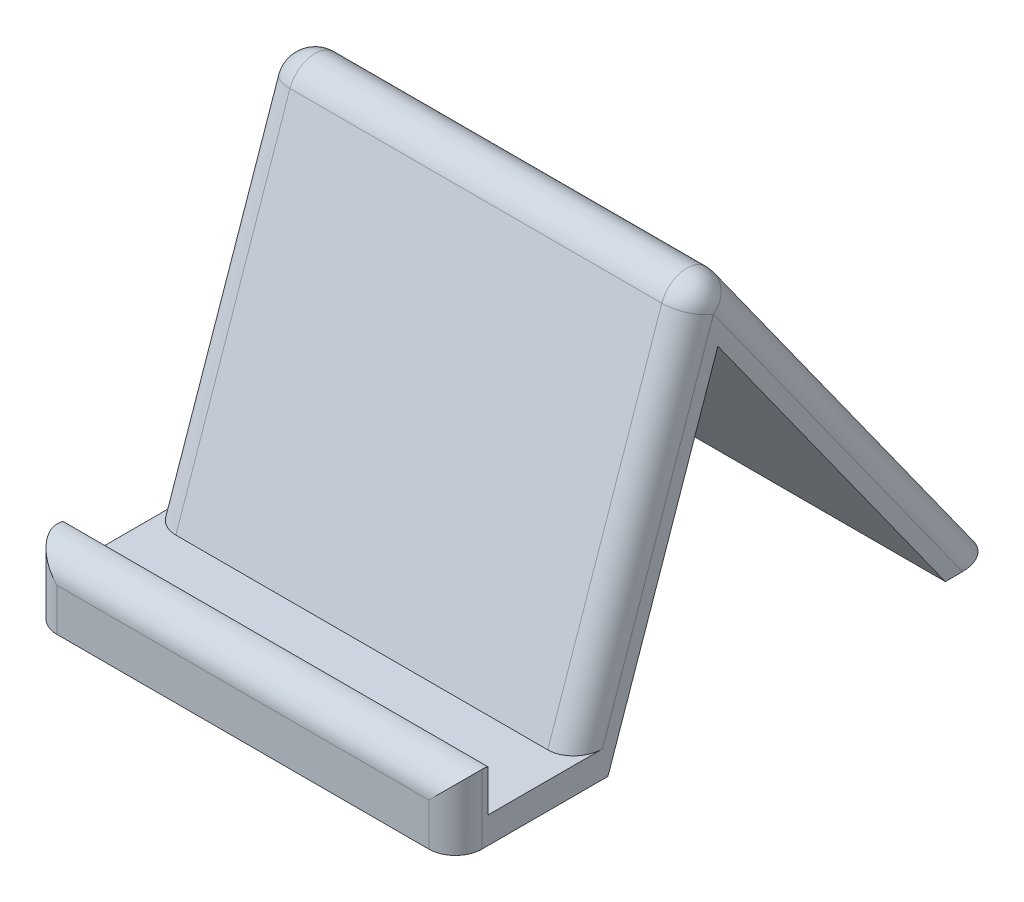
ISO-10303-21;
HEADER;
FILE_DESCRIPTION(('STEP AP214'),'2;1');
FILE_NAME('part.step','',(''),(''),'','','');
FILE_SCHEMA(('AUTOMOTIVE_DESIGN { 1 0 10303 214 1 1 1 1 }'));
ENDSEC;
DATA;
#1=APPLICATION_CONTEXT('core data for automotive mechanical design processes');
#2=APPLICATION_PROTOCOL_DEFINITION('international standard','automotive_design',2000,#1);
#3=PRODUCT_CONTEXT('',#1,'mechanical');
#4=PRODUCT('Part','Part','',(#3));
#5=PRODUCT_RELATED_PRODUCT_CATEGORY('part','',(#4));
#6=PRODUCT_DEFINITION_FORMATION('','',#4);
#7=PRODUCT_DEFINITION_CONTEXT('part definition',#1,'design');
#8=PRODUCT_DEFINITION('design','',#6,#7);
#9=PRODUCT_DEFINITION_SHAPE('','',#8);
#10=(LENGTH_UNIT() NAMED_UNIT(*) SI_UNIT(.MILLI.,.METRE.));
#11=(NAMED_UNIT(*) PLANE_ANGLE_UNIT() SI_UNIT($,.RADIAN.));
#12=(NAMED_UNIT(*) SI_UNIT($,.STERADIAN.) SOLID_ANGLE_UNIT());
#13=UNCERTAINTY_MEASURE_WITH_UNIT(LENGTH_MEASURE(1.E-05),#10,'distance_accuracy_value','');
#14=(GEOMETRIC_REPRESENTATION_CONTEXT(3) GLOBAL_UNCERTAINTY_ASSIGNED_CONTEXT((#13)) GLOBAL_UNIT_ASSIGNED_CONTEXT((#10,
#11,#12)) REPRESENTATION_CONTEXT('',''));
#15=CARTESIAN_POINT('',(0.,0.,0.));
#16=DIRECTION('',(0.,0.,1.));
#17=DIRECTION('',(1.,0.,0.));
#18=AXIS2_PLACEMENT_3D('',#15,#16,#17);
#19=CARTESIAN_POINT('',(0.,0.,0.));
#20=DIRECTION('',(0.,1.,0.));
#21=DIRECTION('',(0.,0.,1.));
#22=AXIS2_PLACEMENT_3D('',#19,#20,#21);
#23=PLANE('',#22);
#24=DIRECTION('',(0.,0.,1.));
#25=VECTOR('',#24,1.);
#26=CARTESIAN_POINT('',(-40.,0.,-50.8));
#27=LINE('',#26,#25);
#28=CARTESIAN_POINT('',(-40.,0.,-44.6495800448227));
#29=VERTEX_POINT('',#28);
#30=CARTESIAN_POINT('',(-40.,0.,-41.4267599883097));
#31=VERTEX_POINT('',#30);
#32=EDGE_CURVE('E245',#29,#31,#27,.T.);
#33=ORIENTED_EDGE('',*,*,#32,.F.);
#34=CARTESIAN_POINT('',(-35.,0.,-44.6495800448227));
#35=DIRECTION('',(0.,1.,0.));
#36=DIRECTION('',(0.,0.,1.));
#37=AXIS2_PLACEMENT_3D('',#34,#35,#36);
#38=ELLIPSE('',#37,6.15041995517734,5.);
#39=CARTESIAN_POINT('',(-35.,0.,-50.8));
#40=VERTEX_POINT('',#39);
#41=EDGE_CURVE('E205',#29,#40,#38,.F.);
#42=ORIENTED_EDGE('',*,*,#41,.T.);
#43=DIRECTION('',(-1.,0.,0.));
#44=VECTOR('',#43,1.);
#45=CARTESIAN_POINT('',(-40.,0.,-50.8));
#46=LINE('',#45,#44);
#47=CARTESIAN_POINT('',(35.,0.,-50.8));
#48=VERTEX_POINT('',#47);
#49=EDGE_CURVE('E312',#48,#40,#46,.T.);
#50=ORIENTED_EDGE('',*,*,#49,.F.);
#51=CARTESIAN_POINT('',(35.,0.,-44.6495800448227));
#52=DIRECTION('',(0.,1.,0.));
#53=DIRECTION('',(0.,0.,1.));
#54=AXIS2_PLACEMENT_3D('',#51,#52,#53);
#55=ELLIPSE('',#54,6.15041995517734,5.);
#56=CARTESIAN_POINT('',(40.,0.,-44.6495800448227));
#57=VERTEX_POINT('',#56);
#58=EDGE_CURVE('E203',#48,#57,#55,.F.);
#59=ORIENTED_EDGE('',*,*,#58,.T.);
#60=DIRECTION('',(0.,0.,-1.));
#61=VECTOR('',#60,1.);
#62=CARTESIAN_POINT('',(40.,0.,-50.8));
#63=LINE('',#62,#61);
#64=CARTESIAN_POINT('',(40.,0.,-41.4267599883097));
#65=VERTEX_POINT('',#64);
#66=EDGE_CURVE('E265',#65,#57,#63,.T.);
#67=ORIENTED_EDGE('',*,*,#66,.F.);
#68=DIRECTION('',(-1.,0.,0.));
#69=VECTOR('',#68,1.);
#70=CARTESIAN_POINT('',(40.,0.,-41.4267599883097));
#71=LINE('',#70,#69);
#72=EDGE_CURVE('E300',#65,#31,#71,.T.);
#73=ORIENTED_EDGE('',*,*,#72,.T.);
#74=EDGE_LOOP('',(#33,#42,#50,#59,#67,#73));
#75=FACE_BOUND('',#74,.T.);
#76=ADVANCED_FACE('F34',(#75),#23,.F.);
#77=CARTESIAN_POINT('',(40.,76.2,-50.8));
#78=DIRECTION('',(-1.,0.,0.));
#79=DIRECTION('',(0.,0.,1.));
#80=AXIS2_PLACEMENT_3D('',#77,#78,#79);
#81=PLANE('',#80);
#82=CARTESIAN_POINT('',(40.,8.01062292072602,45.8));
#83=DIRECTION('',(-1.,0.,0.));
#84=DIRECTION('',(0.,0.,1.));
#85=AXIS2_PLACEMENT_3D('',#82,#83,#84);
#86=CIRCLE('',#85,5.);
#87=CARTESIAN_POINT('',(40.,12.8859553397123,44.6904353086089));
#88=VERTEX_POINT('',#87);
#89=CARTESIAN_POINT('',(40.,13.010622920726,45.8));
#90=VERTEX_POINT('',#89);
#91=EDGE_CURVE('E153',#88,#90,#86,.F.);
#92=ORIENTED_EDGE('',*,*,#91,.T.);
#93=DIRECTION('',(0.,-1.,0.));
#94=VECTOR('',#93,1.);
#95=CARTESIAN_POINT('',(40.,76.2,45.8));
#96=LINE('',#95,#94);
#97=CARTESIAN_POINT('',(40.,0.,45.8));
#98=VERTEX_POINT('',#97);
#99=EDGE_CURVE('E177',#90,#98,#96,.T.);
#100=ORIENTED_EDGE('',*,*,#99,.T.);
#101=CARTESIAN_POINT('',(40.,0.,22.0867780607956));
#102=VERTEX_POINT('',#101);
#103=EDGE_CURVE('E311',#98,#102,#63,.T.);
#104=ORIENTED_EDGE('',*,*,#103,.T.);
#105=DIRECTION('',(0.,0.945024540522138,-0.326999415612509));
#106=VECTOR('',#105,1.);
#107=CARTESIAN_POINT('',(40.,0.,22.0867780607956));
#108=LINE('',#107,#106);
#109=CARTESIAN_POINT('',(40.,59.7866333350471,1.39927914018768));
#110=VERTEX_POINT('',#109);
#111=EDGE_CURVE('E296',#102,#110,#108,.T.);
#112=ORIENTED_EDGE('',*,*,#111,.T.);
#113=DIRECTION('',(0.,-0.812952617290965,-0.582329839558105));
#114=VECTOR('',#113,1.);
#115=CARTESIAN_POINT('',(40.,0.,-41.4267599883097));
#116=LINE('',#115,#114);
#117=EDGE_CURVE('E294',#110,#65,#116,.T.);
#118=ORIENTED_EDGE('',*,*,#117,.T.);
#119=ORIENTED_EDGE('',*,*,#66,.T.);
#120=DIRECTION('',(0.,-0.812952617290966,-0.582329839558105));
#121=VECTOR('',#120,1.);
#122=CARTESIAN_POINT('',(40.,73.2883508022095,7.84793660792689));
#123=LINE('',#122,#121);
#124=CARTESIAN_POINT('',(40.,65.4300743668288,2.21893836314897));
#125=VERTEX_POINT('',#124);
#126=EDGE_CURVE('E182',#57,#125,#123,.F.);
#127=ORIENTED_EDGE('',*,*,#126,.T.);
#128=DIRECTION('',(0.,0.945024540522138,-0.326999415612509));
#129=VECTOR('',#128,1.);
#130=CARTESIAN_POINT('',(40.,3.36500292193743,23.6948273185984));
#131=LINE('',#130,#129);
#132=CARTESIAN_POINT('',(40.,5.00000000000001,23.1290821277283));
#133=VERTEX_POINT('',#132);
#134=EDGE_CURVE('E178',#125,#133,#131,.F.);
#135=ORIENTED_EDGE('',*,*,#134,.T.);
#136=DIRECTION('',(0.,0.,1.));
#137=VECTOR('',#136,1.);
#138=CARTESIAN_POINT('',(40.,5.,-50.8));
#139=LINE('',#138,#137);
#140=CARTESIAN_POINT('',(40.,5.,44.6904353086089));
#141=VERTEX_POINT('',#140);
#142=EDGE_CURVE('E156',#133,#141,#139,.T.);
#143=ORIENTED_EDGE('',*,*,#142,.T.);
#144=DIRECTION('',(0.,1.,0.));
#145=VECTOR('',#144,1.);
#146=CARTESIAN_POINT('',(40.,76.2,44.6904353086089));
#147=LINE('',#146,#145);
#148=EDGE_CURVE('E148',#141,#88,#147,.T.);
#149=ORIENTED_EDGE('',*,*,#148,.T.);
#150=EDGE_LOOP('',(#92,#100,#104,#112,#118,#119,#127,#135,#143,#149));
#151=FACE_BOUND('',#150,.T.);
#152=ADVANCED_FACE('F150',(#151),#81,.F.);
#153=CARTESIAN_POINT('',(-40.,76.2,-50.8));
#154=DIRECTION('',(1.,0.,0.));
#155=DIRECTION('',(0.,0.,-1.));
#156=AXIS2_PLACEMENT_3D('',#153,#154,#155);
#157=PLANE('',#156);
#158=DIRECTION('',(0.,-1.,0.));
#159=VECTOR('',#158,1.);
#160=CARTESIAN_POINT('',(-40.,76.2,45.8));
#161=LINE('',#160,#159);
#162=CARTESIAN_POINT('',(-40.,0.,45.8));
#163=VERTEX_POINT('',#162);
#164=CARTESIAN_POINT('',(-40.,13.010622920726,45.8));
#165=VERTEX_POINT('',#164);
#166=EDGE_CURVE('E199',#163,#165,#161,.F.);
#167=ORIENTED_EDGE('',*,*,#166,.T.);
#168=CARTESIAN_POINT('',(-40.,8.01062292072602,45.8));
#169=DIRECTION('',(1.,0.,0.));
#170=DIRECTION('',(0.,0.,-1.));
#171=AXIS2_PLACEMENT_3D('',#168,#169,#170);
#172=CIRCLE('',#171,5.);
#173=CARTESIAN_POINT('',(-40.,12.8859553397123,44.6904353086089));
#174=VERTEX_POINT('',#173);
#175=EDGE_CURVE('E201',#165,#174,#172,.F.);
#176=ORIENTED_EDGE('',*,*,#175,.T.);
#177=DIRECTION('',(0.,-1.,0.));
#178=VECTOR('',#177,1.);
#179=CARTESIAN_POINT('',(-40.,76.2,44.6904353086089));
#180=LINE('',#179,#178);
#181=CARTESIAN_POINT('',(-40.,5.,44.6904353086089));
#182=VERTEX_POINT('',#181);
#183=EDGE_CURVE('E160',#174,#182,#180,.T.);
#184=ORIENTED_EDGE('',*,*,#183,.T.);
#185=DIRECTION('',(0.,0.,-1.));
#186=VECTOR('',#185,1.);
#187=CARTESIAN_POINT('',(-40.,5.,-50.8));
#188=LINE('',#187,#186);
#189=CARTESIAN_POINT('',(-40.,5.00000000000001,23.1290821277283));
#190=VERTEX_POINT('',#189);
#191=EDGE_CURVE('E168',#182,#190,#188,.T.);
#192=ORIENTED_EDGE('',*,*,#191,.T.);
#193=DIRECTION('',(0.,0.945024540522138,-0.326999415612509));
#194=VECTOR('',#193,1.);
#195=CARTESIAN_POINT('',(-40.,74.5650029219375,-0.94194918113862));
#196=LINE('',#195,#194);
#197=CARTESIAN_POINT('',(-40.,65.4300743668288,2.21893836314899));
#198=VERTEX_POINT('',#197);
#199=EDGE_CURVE('E197',#190,#198,#196,.T.);
#200=ORIENTED_EDGE('',*,*,#199,.T.);
#201=DIRECTION('',(0.,-0.812952617290966,-0.582329839558105));
#202=VECTOR('',#201,1.);
#203=CARTESIAN_POINT('',(-40.,-2.91164919779054,-46.7352369135452));
#204=LINE('',#203,#202);
#205=EDGE_CURVE('E195',#198,#29,#204,.T.);
#206=ORIENTED_EDGE('',*,*,#205,.T.);
#207=ORIENTED_EDGE('',*,*,#32,.T.);
#208=DIRECTION('',(0.,-0.812952617290965,-0.582329839558105));
#209=VECTOR('',#208,1.);
#210=CARTESIAN_POINT('',(-40.,0.,-41.4267599883097));
#211=LINE('',#210,#209);
#212=CARTESIAN_POINT('',(-40.,59.7866333350471,1.39927914018768));
#213=VERTEX_POINT('',#212);
#214=EDGE_CURVE('E293',#213,#31,#211,.T.);
#215=ORIENTED_EDGE('',*,*,#214,.F.);
#216=DIRECTION('',(0.,0.945024540522138,-0.326999415612509));
#217=VECTOR('',#216,1.);
#218=CARTESIAN_POINT('',(-40.,0.,22.0867780607956));
#219=LINE('',#218,#217);
#220=CARTESIAN_POINT('',(-40.,0.,22.0867780607956));
#221=VERTEX_POINT('',#220);
#222=EDGE_CURVE('E297',#221,#213,#219,.T.);
#223=ORIENTED_EDGE('',*,*,#222,.F.);
#224=EDGE_CURVE('E247',#221,#163,#27,.T.);
#225=ORIENTED_EDGE('',*,*,#224,.T.);
#226=EDGE_LOOP('',(#167,#176,#184,#192,#200,#206,#207,#215,#223,#225));
#227=FACE_BOUND('',#226,.T.);
#228=ADVANCED_FACE('F316',(#227),#157,.F.);
#229=CARTESIAN_POINT('',(-40.,76.2,50.8));
#230=DIRECTION('',(0.,0.,-1.));
#231=DIRECTION('',(-1.,0.,0.));
#232=AXIS2_PLACEMENT_3D('',#229,#230,#231);
#233=PLANE('',#232);
#234=DIRECTION('',(1.,0.,0.));
#235=VECTOR('',#234,1.);
#236=CARTESIAN_POINT('',(-40.,0.,50.8));
#237=LINE('',#236,#235);
#238=CARTESIAN_POINT('',(-35.,0.,50.8));
#239=VERTEX_POINT('',#238);
#240=CARTESIAN_POINT('',(35.,0.,50.8));
#241=VERTEX_POINT('',#240);
#242=EDGE_CURVE('E169',#239,#241,#237,.T.);
#243=ORIENTED_EDGE('',*,*,#242,.T.);
#244=DIRECTION('',(0.,-1.,0.));
#245=VECTOR('',#244,1.);
#246=CARTESIAN_POINT('',(35.,76.2,50.8));
#247=LINE('',#246,#245);
#248=CARTESIAN_POINT('',(35.,8.01062292072602,50.8));
#249=VERTEX_POINT('',#248);
#250=EDGE_CURVE('E193',#241,#249,#247,.F.);
#251=ORIENTED_EDGE('',*,*,#250,.T.);
#252=DIRECTION('',(1.,0.,0.));
#253=VECTOR('',#252,1.);
#254=CARTESIAN_POINT('',(-40.,8.01062292072602,50.8));
#255=LINE('',#254,#253);
#256=CARTESIAN_POINT('',(-35.,8.01062292072602,50.8));
#257=VERTEX_POINT('',#256);
#258=EDGE_CURVE('E191',#249,#257,#255,.F.);
#259=ORIENTED_EDGE('',*,*,#258,.T.);
#260=DIRECTION('',(0.,-1.,0.));
#261=VECTOR('',#260,1.);
#262=CARTESIAN_POINT('',(-35.,76.2,50.8));
#263=LINE('',#262,#261);
#264=EDGE_CURVE('E189',#257,#239,#263,.T.);
#265=ORIENTED_EDGE('',*,*,#264,.T.);
#266=EDGE_LOOP('',(#243,#251,#259,#265));
#267=FACE_BOUND('',#266,.T.);
#268=ADVANCED_FACE('F239',(#267),#233,.F.);
#269=ORIENTED_EDGE('',*,*,#103,.F.);
#270=CARTESIAN_POINT('',(35.,0.,45.8));
#271=DIRECTION('',(0.,1.,0.));
#272=DIRECTION('',(0.,0.,1.));
#273=AXIS2_PLACEMENT_3D('',#270,#271,#272);
#274=CIRCLE('',#273,5.);
#275=EDGE_CURVE('E187',#98,#241,#274,.F.);
#276=ORIENTED_EDGE('',*,*,#275,.T.);
#277=ORIENTED_EDGE('',*,*,#242,.F.);
#278=CARTESIAN_POINT('',(-35.,0.,45.8));
#279=DIRECTION('',(0.,1.,0.));
#280=DIRECTION('',(0.,0.,1.));
#281=AXIS2_PLACEMENT_3D('',#278,#279,#280);
#282=CIRCLE('',#281,5.);
#283=EDGE_CURVE('E180',#239,#163,#282,.F.);
#284=ORIENTED_EDGE('',*,*,#283,.T.);
#285=ORIENTED_EDGE('',*,*,#224,.F.);
#286=DIRECTION('',(-1.,0.,0.));
#287=VECTOR('',#286,1.);
#288=CARTESIAN_POINT('',(40.,0.,22.0867780607956));
#289=LINE('',#288,#287);
#290=EDGE_CURVE('E307',#102,#221,#289,.T.);
#291=ORIENTED_EDGE('',*,*,#290,.F.);
#292=EDGE_LOOP('',(#269,#276,#277,#284,#285,#291));
#293=FACE_BOUND('',#292,.T.);
#294=ADVANCED_FACE('F242',(#293),#23,.F.);
#295=CARTESIAN_POINT('',(40.,0.,-50.8));
#296=DIRECTION('',(0.,0.582329839558105,-0.812952617290966));
#297=DIRECTION('',(0.,0.812952617290966,0.582329839558105));
#298=AXIS2_PLACEMENT_3D('',#295,#296,#297);
#299=PLANE('',#298);
#300=ORIENTED_EDGE('',*,*,#49,.T.);
#301=DIRECTION('',(0.,-0.812952617290966,-0.582329839558105));
#302=VECTOR('',#301,1.);
#303=CARTESIAN_POINT('',(-35.,76.2,3.78317352147206));
#304=LINE('',#303,#302);
#305=CARTESIAN_POINT('',(-35.,68.3417235646194,-1.84582472330585));
#306=VERTEX_POINT('',#305);
#307=EDGE_CURVE('E56',#40,#306,#304,.F.);
#308=ORIENTED_EDGE('',*,*,#307,.T.);
#309=DIRECTION('',(-1.,0.,0.));
#310=VECTOR('',#309,1.);
#311=CARTESIAN_POINT('',(40.,68.3417235646193,-1.84582472330586));
#312=LINE('',#311,#310);
#313=CARTESIAN_POINT('',(35.,68.3417235646194,-1.84582472330585));
#314=VERTEX_POINT('',#313);
#315=EDGE_CURVE('E51',#306,#314,#312,.F.);
#316=ORIENTED_EDGE('',*,*,#315,.T.);
#317=DIRECTION('',(0.,-0.812952617290966,-0.582329839558105));
#318=VECTOR('',#317,1.);
#319=CARTESIAN_POINT('',(35.,0.,-50.8));
#320=LINE('',#319,#318);
#321=EDGE_CURVE('E208',#314,#48,#320,.T.);
#322=ORIENTED_EDGE('',*,*,#321,.T.);
#323=EDGE_LOOP('',(#300,#308,#316,#322));
#324=FACE_BOUND('',#323,.T.);
#325=ADVANCED_FACE('F341',(#324),#299,.T.);
#326=CARTESIAN_POINT('',(40.,76.2,3.78317352147207));
#327=DIRECTION('',(0.,0.326999415612509,0.945024540522138));
#328=DIRECTION('',(0.,-0.945024540522138,0.326999415612509));
#329=AXIS2_PLACEMENT_3D('',#326,#327,#328);
#330=PLANE('',#329);
#331=DIRECTION('',(1.,0.,0.));
#332=VECTOR('',#331,1.);
#333=CARTESIAN_POINT('',(-327.62079442322,5.,28.4199500212091));
#334=LINE('',#333,#332);
#335=CARTESIAN_POINT('',(-35.,5.,28.4199500212091));
#336=VERTEX_POINT('',#335);
#337=CARTESIAN_POINT('',(35.,5.,28.4199500212091));
#338=VERTEX_POINT('',#337);
#339=EDGE_CURVE('E285',#336,#338,#334,.T.);
#340=ORIENTED_EDGE('',*,*,#339,.T.);
#341=DIRECTION('',(0.,0.945024540522138,-0.326999415612509));
#342=VECTOR('',#341,1.);
#343=CARTESIAN_POINT('',(35.,76.2,3.78317352147207));
#344=LINE('',#343,#342);
#345=CARTESIAN_POINT('',(35.,67.0650714448914,6.94406106575967));
#346=VERTEX_POINT('',#345);
#347=EDGE_CURVE('E256',#338,#346,#344,.T.);
#348=ORIENTED_EDGE('',*,*,#347,.T.);
#349=DIRECTION('',(-1.,0.,0.));
#350=VECTOR('',#349,1.);
#351=CARTESIAN_POINT('',(40.,67.0650714448914,6.94406106575967));
#352=LINE('',#351,#350);
#353=CARTESIAN_POINT('',(-35.,67.0650714448914,6.94406106575967));
#354=VERTEX_POINT('',#353);
#355=EDGE_CURVE('E252',#346,#354,#352,.T.);
#356=ORIENTED_EDGE('',*,*,#355,.T.);
#357=DIRECTION('',(0.,0.945024540522138,-0.326999415612509));
#358=VECTOR('',#357,1.);
#359=CARTESIAN_POINT('',(-35.,4.99999999999998,28.4199500212091));
#360=LINE('',#359,#358);
#361=EDGE_CURVE('E254',#354,#336,#360,.F.);
#362=ORIENTED_EDGE('',*,*,#361,.T.);
#363=EDGE_LOOP('',(#340,#348,#356,#362));
#364=FACE_BOUND('',#363,.T.);
#365=ADVANCED_FACE('F283',(#364),#330,.T.);
#366=CARTESIAN_POINT('',(40.,0.,-41.4267599883097));
#367=DIRECTION('',(0.,0.582329839558105,-0.812952617290966));
#368=DIRECTION('',(0.,0.812952617290966,0.582329839558105));
#369=AXIS2_PLACEMENT_3D('',#366,#367,#368);
#370=PLANE('',#369);
#371=ORIENTED_EDGE('',*,*,#214,.T.);
#372=ORIENTED_EDGE('',*,*,#72,.F.);
#373=ORIENTED_EDGE('',*,*,#117,.F.);
#374=DIRECTION('',(-1.,0.,0.));
#375=VECTOR('',#374,1.);
#376=CARTESIAN_POINT('',(40.,59.7866333350471,1.39927914018768));
#377=LINE('',#376,#375);
#378=EDGE_CURVE('E305',#110,#213,#377,.T.);
#379=ORIENTED_EDGE('',*,*,#378,.T.);
#380=EDGE_LOOP('',(#371,#372,#373,#379));
#381=FACE_BOUND('',#380,.T.);
#382=ADVANCED_FACE('F381',(#381),#370,.F.);
#383=CARTESIAN_POINT('',(40.,0.,22.0867780607956));
#384=DIRECTION('',(0.,0.326999415612509,0.945024540522138));
#385=DIRECTION('',(0.,-0.945024540522138,0.326999415612509));
#386=AXIS2_PLACEMENT_3D('',#383,#384,#385);
#387=PLANE('',#386);
#388=ORIENTED_EDGE('',*,*,#222,.T.);
#389=ORIENTED_EDGE('',*,*,#378,.F.);
#390=ORIENTED_EDGE('',*,*,#111,.F.);
#391=ORIENTED_EDGE('',*,*,#290,.T.);
#392=EDGE_LOOP('',(#388,#389,#390,#391));
#393=FACE_BOUND('',#392,.T.);
#394=ADVANCED_FACE('F321',(#393),#387,.F.);
#395=CARTESIAN_POINT('',(-327.62079442322,5.,28.4199500212091));
#396=DIRECTION('',(0.,-1.,0.));
#397=DIRECTION('',(0.,0.,-1.));
#398=AXIS2_PLACEMENT_3D('',#395,#396,#397);
#399=PLANE('',#398);
#400=ORIENTED_EDGE('',*,*,#142,.F.);
#401=CARTESIAN_POINT('',(35.,5.,23.1290821277283));
#402=DIRECTION('',(0.,-1.,0.));
#403=DIRECTION('',(0.,0.,1.));
#404=AXIS2_PLACEMENT_3D('',#401,#402,#403);
#405=ELLIPSE('',#404,5.29086789348077,5.);
#406=EDGE_CURVE('E43',#133,#338,#405,.T.);
#407=ORIENTED_EDGE('',*,*,#406,.T.);
#408=ORIENTED_EDGE('',*,*,#339,.F.);
#409=CARTESIAN_POINT('',(-35.,5.,23.1290821277283));
#410=DIRECTION('',(0.,-1.,0.));
#411=DIRECTION('',(0.,0.,1.));
#412=AXIS2_PLACEMENT_3D('',#409,#410,#411);
#413=ELLIPSE('',#412,5.29086789348077,5.);
#414=EDGE_CURVE('E12',#336,#190,#413,.T.);
#415=ORIENTED_EDGE('',*,*,#414,.T.);
#416=ORIENTED_EDGE('',*,*,#191,.F.);
#417=DIRECTION('',(1.,0.,0.));
#418=VECTOR('',#417,1.);
#419=CARTESIAN_POINT('',(-327.62079442322,5.,44.6904353086089));
#420=LINE('',#419,#418);
#421=EDGE_CURVE('E228',#182,#141,#420,.T.);
#422=ORIENTED_EDGE('',*,*,#421,.T.);
#423=EDGE_LOOP('',(#400,#407,#408,#415,#416,#422));
#424=FACE_BOUND('',#423,.T.);
#425=ADVANCED_FACE('F373',(#424),#399,.F.);
#426=CARTESIAN_POINT('',(-327.62079442322,12.8859553397123,44.6904353086089));
#427=DIRECTION('',(0.,0.,1.));
#428=DIRECTION('',(1.,0.,0.));
#429=AXIS2_PLACEMENT_3D('',#426,#427,#428);
#430=PLANE('',#429);
#431=ORIENTED_EDGE('',*,*,#148,.F.);
#432=ORIENTED_EDGE('',*,*,#421,.F.);
#433=ORIENTED_EDGE('',*,*,#183,.F.);
#434=DIRECTION('',(1.,0.,0.));
#435=VECTOR('',#434,1.);
#436=CARTESIAN_POINT('',(40.,12.8859553397123,44.6904353086089));
#437=LINE('',#436,#435);
#438=EDGE_CURVE('E164',#174,#88,#437,.T.);
#439=ORIENTED_EDGE('',*,*,#438,.T.);
#440=EDGE_LOOP('',(#431,#432,#433,#439));
#441=FACE_BOUND('',#440,.T.);
#442=ADVANCED_FACE('F165',(#441),#430,.F.);
#443=CARTESIAN_POINT('',(-35.,91.4324301599054,-6.77845248152335));
#444=DIRECTION('',(0.,-0.945024540522138,0.326999415612509));
#445=DIRECTION('',(0.,-0.326999415612509,-0.945024540522138));
#446=AXIS2_PLACEMENT_3D('',#443,#444,#445);
#447=CYLINDRICAL_SURFACE('',#446,5.);
#448=ORIENTED_EDGE('',*,*,#414,.F.);
#449=ORIENTED_EDGE('',*,*,#361,.F.);
#450=CARTESIAN_POINT('',(-35.,65.4300743668288,2.21893836314897));
#451=DIRECTION('',(0.,0.94502454052214,-0.326999415612503));
#452=DIRECTION('',(0.,0.326999415612503,0.94502454052214));
#453=AXIS2_PLACEMENT_3D('',#450,#451,#452);
#454=CIRCLE('',#453,5.);
#455=EDGE_CURVE('E226',#198,#354,#454,.T.);
#456=ORIENTED_EDGE('',*,*,#455,.F.);
#457=ORIENTED_EDGE('',*,*,#199,.F.);
#458=EDGE_LOOP('',(#448,#449,#456,#457));
#459=FACE_BOUND('',#458,.T.);
#460=ADVANCED_FACE('F366',(#459),#447,.T.);
#461=CARTESIAN_POINT('',(-35.,47.4483179987791,-10.6616564932565));
#462=DIRECTION('',(0.,0.812952617290966,0.582329839558105));
#463=DIRECTION('',(0.,-0.582329839558105,0.812952617290966));
#464=AXIS2_PLACEMENT_3D('',#461,#462,#463);
#465=CYLINDRICAL_SURFACE('',#464,5.);
#466=ORIENTED_EDGE('',*,*,#41,.F.);
#467=ORIENTED_EDGE('',*,*,#205,.F.);
#468=CARTESIAN_POINT('',(-35.,65.4300743668288,2.21893836314897));
#469=DIRECTION('',(0.,0.812952617290966,0.582329839558105));
#470=DIRECTION('',(0.,-0.582329839558105,0.812952617290966));
#471=AXIS2_PLACEMENT_3D('',#468,#469,#470);
#472=CIRCLE('',#471,5.);
#473=EDGE_CURVE('E223',#306,#198,#472,.T.);
#474=ORIENTED_EDGE('',*,*,#473,.F.);
#475=ORIENTED_EDGE('',*,*,#307,.F.);
#476=EDGE_LOOP('',(#466,#467,#474,#475));
#477=FACE_BOUND('',#476,.T.);
#478=ADVANCED_FACE('F363',(#477),#465,.T.);
#479=CARTESIAN_POINT('',(-35.,65.4300743668288,2.21893836314898));
#480=DIRECTION('',(0.,0.,1.));
#481=DIRECTION('',(1.,0.,0.));
#482=AXIS2_PLACEMENT_3D('',#479,#480,#481);
#483=SPHERICAL_SURFACE('',#482,5.);
#484=ORIENTED_EDGE('',*,*,#473,.T.);
#485=ORIENTED_EDGE('',*,*,#455,.T.);
#486=CARTESIAN_POINT('',(-35.,65.4300743668288,2.21893836314898));
#487=DIRECTION('',(-1.,0.,0.));
#488=DIRECTION('',(0.,-1.,0.));
#489=AXIS2_PLACEMENT_3D('',#486,#487,#488);
#490=CIRCLE('',#489,5.);
#491=EDGE_CURVE('E220',#306,#354,#490,.F.);
#492=ORIENTED_EDGE('',*,*,#491,.F.);
#493=EDGE_LOOP('',(#484,#485,#492));
#494=FACE_BOUND('',#493,.T.);
#495=ADVANCED_FACE('F360',(#494),#483,.T.);
#496=CARTESIAN_POINT('',(40.,65.4300743668288,2.21893836314898));
#497=DIRECTION('',(-1.,0.,0.));
#498=DIRECTION('',(0.,0.,1.));
#499=AXIS2_PLACEMENT_3D('',#496,#497,#498);
#500=CYLINDRICAL_SURFACE('',#499,5.);
#501=ORIENTED_EDGE('',*,*,#491,.T.);
#502=ORIENTED_EDGE('',*,*,#355,.F.);
#503=CARTESIAN_POINT('',(35.,65.4300743668288,2.21893836314897));
#504=DIRECTION('',(1.,0.,0.));
#505=DIRECTION('',(0.,0.,-1.));
#506=AXIS2_PLACEMENT_3D('',#503,#504,#505);
#507=CIRCLE('',#506,5.);
#508=EDGE_CURVE('E217',#314,#346,#507,.T.);
#509=ORIENTED_EDGE('',*,*,#508,.F.);
#510=ORIENTED_EDGE('',*,*,#315,.F.);
#511=EDGE_LOOP('',(#501,#502,#509,#510));
#512=FACE_BOUND('',#511,.T.);
#513=ADVANCED_FACE('F278',(#512),#500,.T.);
#514=CARTESIAN_POINT('',(35.,-2.91164919779053,-46.7352369135452));
#515=DIRECTION('',(0.,0.812952617290966,0.582329839558105));
#516=DIRECTION('',(0.,-0.582329839558105,0.812952617290966));
#517=AXIS2_PLACEMENT_3D('',#514,#515,#516);
#518=CYLINDRICAL_SURFACE('',#517,5.);
#519=ORIENTED_EDGE('',*,*,#58,.F.);
#520=ORIENTED_EDGE('',*,*,#321,.F.);
#521=CARTESIAN_POINT('',(35.,65.4300743668288,2.21893836314898));
#522=DIRECTION('',(0.,0.812952617290966,0.582329839558105));
#523=DIRECTION('',(0.,-0.582329839558105,0.812952617290966));
#524=AXIS2_PLACEMENT_3D('',#521,#522,#523);
#525=CIRCLE('',#524,5.);
#526=EDGE_CURVE('E214',#125,#314,#525,.T.);
#527=ORIENTED_EDGE('',*,*,#526,.F.);
#528=ORIENTED_EDGE('',*,*,#126,.F.);
#529=EDGE_LOOP('',(#519,#520,#527,#528));
#530=FACE_BOUND('',#529,.T.);
#531=ADVANCED_FACE('F268',(#530),#518,.T.);
#532=CARTESIAN_POINT('',(35.,65.4300743668288,2.21893836314898));
#533=DIRECTION('',(0.,0.,1.));
#534=DIRECTION('',(1.,0.,0.));
#535=AXIS2_PLACEMENT_3D('',#532,#533,#534);
#536=SPHERICAL_SURFACE('',#535,5.);
#537=ORIENTED_EDGE('',*,*,#526,.T.);
#538=ORIENTED_EDGE('',*,*,#508,.T.);
#539=CARTESIAN_POINT('',(35.,65.4300743668288,2.21893836314898));
#540=DIRECTION('',(0.,0.945024540522138,-0.326999415612508));
#541=DIRECTION('',(0.,0.326999415612508,0.945024540522138));
#542=AXIS2_PLACEMENT_3D('',#539,#540,#541);
#543=CIRCLE('',#542,5.);
#544=EDGE_CURVE('E212',#125,#346,#543,.F.);
#545=ORIENTED_EDGE('',*,*,#544,.F.);
#546=EDGE_LOOP('',(#537,#538,#545));
#547=FACE_BOUND('',#546,.T.);
#548=ADVANCED_FACE('F275',(#547),#536,.T.);
#549=CARTESIAN_POINT('',(35.,74.5650029219375,-0.941949181138623));
#550=DIRECTION('',(0.,-0.945024540522138,0.326999415612509));
#551=DIRECTION('',(0.,-0.326999415612509,-0.945024540522138));
#552=AXIS2_PLACEMENT_3D('',#549,#550,#551);
#553=CYLINDRICAL_SURFACE('',#552,5.);
#554=ORIENTED_EDGE('',*,*,#406,.F.);
#555=ORIENTED_EDGE('',*,*,#134,.F.);
#556=ORIENTED_EDGE('',*,*,#544,.T.);
#557=ORIENTED_EDGE('',*,*,#347,.F.);
#558=EDGE_LOOP('',(#554,#555,#556,#557));
#559=FACE_BOUND('',#558,.T.);
#560=ADVANCED_FACE('F273',(#559),#553,.T.);
#561=CARTESIAN_POINT('',(-35.,76.2,45.8));
#562=DIRECTION('',(0.,-1.,0.));
#563=DIRECTION('',(0.,0.,-1.));
#564=AXIS2_PLACEMENT_3D('',#561,#562,#563);
#565=CYLINDRICAL_SURFACE('',#564,5.);
#566=ORIENTED_EDGE('',*,*,#283,.F.);
#567=ORIENTED_EDGE('',*,*,#264,.F.);
#568=CARTESIAN_POINT('',(-35.,8.01062292072602,45.8));
#569=DIRECTION('',(-0.707106781186547,-0.707106781186547,0.));
#570=DIRECTION('',(0.707106781186547,-0.707106781186547,0.));
#571=AXIS2_PLACEMENT_3D('',#568,#569,#570);
#572=ELLIPSE('',#571,7.07106781186547,5.);
#573=EDGE_CURVE('E38',#165,#257,#572,.F.);
#574=ORIENTED_EDGE('',*,*,#573,.F.);
#575=ORIENTED_EDGE('',*,*,#166,.F.);
#576=EDGE_LOOP('',(#566,#567,#574,#575));
#577=FACE_BOUND('',#576,.T.);
#578=ADVANCED_FACE('F36',(#577),#565,.T.);
#579=CARTESIAN_POINT('',(40.,8.01062292072602,45.8));
#580=DIRECTION('',(1.,0.,0.));
#581=DIRECTION('',(0.,0.,-1.));
#582=AXIS2_PLACEMENT_3D('',#579,#580,#581);
#583=CYLINDRICAL_SURFACE('',#582,5.);
#584=ORIENTED_EDGE('',*,*,#573,.T.);
#585=ORIENTED_EDGE('',*,*,#258,.F.);
#586=CARTESIAN_POINT('',(35.,8.01062292072602,45.8));
#587=DIRECTION('',(0.707106781186547,-0.707106781186547,0.));
#588=DIRECTION('',(0.707106781186547,0.707106781186547,0.));
#589=AXIS2_PLACEMENT_3D('',#586,#587,#588);
#590=ELLIPSE('',#589,7.07106781186547,5.);
#591=EDGE_CURVE('E175',#90,#249,#590,.T.);
#592=ORIENTED_EDGE('',*,*,#591,.F.);
#593=ORIENTED_EDGE('',*,*,#91,.F.);
#594=ORIENTED_EDGE('',*,*,#438,.F.);
#595=ORIENTED_EDGE('',*,*,#175,.F.);
#596=EDGE_LOOP('',(#584,#585,#592,#593,#594,#595));
#597=FACE_BOUND('',#596,.T.);
#598=ADVANCED_FACE('F172',(#597),#583,.T.);
#599=CARTESIAN_POINT('',(35.,76.2,45.8));
#600=DIRECTION('',(0.,-1.,0.));
#601=DIRECTION('',(0.,0.,-1.));
#602=AXIS2_PLACEMENT_3D('',#599,#600,#601);
#603=CYLINDRICAL_SURFACE('',#602,5.);
#604=ORIENTED_EDGE('',*,*,#591,.T.);
#605=ORIENTED_EDGE('',*,*,#250,.F.);
#606=ORIENTED_EDGE('',*,*,#275,.F.);
#607=ORIENTED_EDGE('',*,*,#99,.F.);
#608=EDGE_LOOP('',(#604,#605,#606,#607));
#609=FACE_BOUND('',#608,.T.);
#610=ADVANCED_FACE('F323',(#609),#603,.T.);
#611=CLOSED_SHELL('',(#76,#152,#228,#268,#294,#325,#365,#382,#394,#425,#442,#460,#478,#495,#513,
#531,#548,#560,#578,#598,#610));
#612=MANIFOLD_SOLID_BREP('B2',#611);
#613=ADVANCED_BREP_SHAPE_REPRESENTATION('',(#18,#612),#14);
#614=SHAPE_DEFINITION_REPRESENTATION(#9,#613);
ENDSEC;
END-ISO-10303-21;
